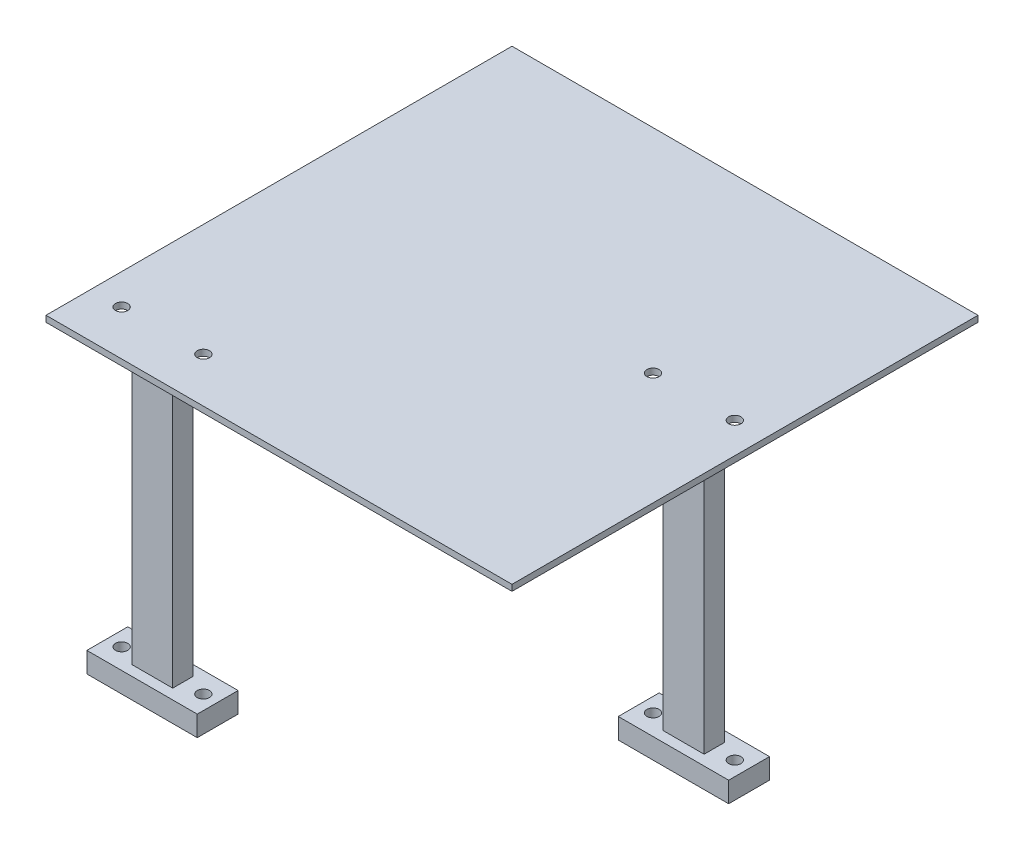
ISO-10303-21;
HEADER;
FILE_DESCRIPTION(('STEP AP214'),'2;1');
FILE_NAME('part.step','',(''),(''),'','','');
FILE_SCHEMA(('AUTOMOTIVE_DESIGN { 1 0 10303 214 1 1 1 1 }'));
ENDSEC;
DATA;
#1=APPLICATION_CONTEXT('core data for automotive mechanical design processes');
#2=APPLICATION_PROTOCOL_DEFINITION('international standard','automotive_design',2000,#1);
#3=PRODUCT_CONTEXT('',#1,'mechanical');
#4=PRODUCT('Part','Part','',(#3));
#5=PRODUCT_RELATED_PRODUCT_CATEGORY('part','',(#4));
#6=PRODUCT_DEFINITION_FORMATION('','',#4);
#7=PRODUCT_DEFINITION_CONTEXT('part definition',#1,'design');
#8=PRODUCT_DEFINITION('design','',#6,#7);
#9=PRODUCT_DEFINITION_SHAPE('','',#8);
#10=(LENGTH_UNIT() NAMED_UNIT(*) SI_UNIT(.MILLI.,.METRE.));
#11=(NAMED_UNIT(*) PLANE_ANGLE_UNIT() SI_UNIT($,.RADIAN.));
#12=(NAMED_UNIT(*) SI_UNIT($,.STERADIAN.) SOLID_ANGLE_UNIT());
#13=UNCERTAINTY_MEASURE_WITH_UNIT(LENGTH_MEASURE(1.E-05),#10,'distance_accuracy_value','');
#14=(GEOMETRIC_REPRESENTATION_CONTEXT(3) GLOBAL_UNCERTAINTY_ASSIGNED_CONTEXT((#13)) GLOBAL_UNIT_ASSIGNED_CONTEXT((#10,
#11,#12)) REPRESENTATION_CONTEXT('',''));
#15=CARTESIAN_POINT('',(0.,0.,0.));
#16=DIRECTION('',(0.,0.,1.));
#17=DIRECTION('',(1.,0.,0.));
#18=AXIS2_PLACEMENT_3D('',#15,#16,#17);
#19=CARTESIAN_POINT('',(0.,1.5,0.));
#20=DIRECTION('',(0.,-1.,0.));
#21=DIRECTION('',(0.,0.,-1.));
#22=AXIS2_PLACEMENT_3D('',#19,#20,#21);
#23=PLANE('',#22);
#24=DIRECTION('',(-1.,0.,0.));
#25=VECTOR('',#24,1.);
#26=CARTESIAN_POINT('',(-57.,1.5,-57.));
#27=LINE('',#26,#25);
#28=CARTESIAN_POINT('',(57.,1.5,-57.));
#29=VERTEX_POINT('',#28);
#30=CARTESIAN_POINT('',(-57.,1.5,-57.));
#31=VERTEX_POINT('',#30);
#32=EDGE_CURVE('E312',#29,#31,#27,.T.);
#33=ORIENTED_EDGE('',*,*,#32,.T.);
#34=DIRECTION('',(0.,0.,1.));
#35=VECTOR('',#34,1.);
#36=CARTESIAN_POINT('',(-57.,1.5,-57.));
#37=LINE('',#36,#35);
#38=CARTESIAN_POINT('',(-57.,1.5,57.));
#39=VERTEX_POINT('',#38);
#40=EDGE_CURVE('E315',#31,#39,#37,.T.);
#41=ORIENTED_EDGE('',*,*,#40,.T.);
#42=DIRECTION('',(1.,0.,0.));
#43=VECTOR('',#42,1.);
#44=CARTESIAN_POINT('',(-57.,1.5,57.));
#45=LINE('',#44,#43);
#46=CARTESIAN_POINT('',(57.,1.5,57.));
#47=VERTEX_POINT('',#46);
#48=EDGE_CURVE('E318',#39,#47,#45,.T.);
#49=ORIENTED_EDGE('',*,*,#48,.T.);
#50=DIRECTION('',(0.,0.,-1.));
#51=VECTOR('',#50,1.);
#52=CARTESIAN_POINT('',(57.,1.5,-57.));
#53=LINE('',#52,#51);
#54=EDGE_CURVE('E320',#47,#29,#53,.T.);
#55=ORIENTED_EDGE('',*,*,#54,.T.);
#56=EDGE_LOOP('',(#33,#41,#49,#55));
#57=FACE_BOUND('',#56,.T.);
#58=CARTESIAN_POINT('',(29.5,1.5,-5.00000000000001));
#59=DIRECTION('',(0.,1.,0.));
#60=DIRECTION('',(0.,0.,1.));
#61=AXIS2_PLACEMENT_3D('',#58,#59,#60);
#62=CIRCLE('',#61,1.5);
#63=CARTESIAN_POINT('',(29.5,1.5,-3.50000000000001));
#64=VERTEX_POINT('',#63);
#65=EDGE_CURVE('E306',#64,#64,#62,.T.);
#66=ORIENTED_EDGE('',*,*,#65,.F.);
#67=EDGE_LOOP('',(#66));
#68=FACE_BOUND('',#67,.T.);
#69=CARTESIAN_POINT('',(49.5,1.5,-5.00000000000002));
#70=DIRECTION('',(0.,1.,0.));
#71=DIRECTION('',(0.,0.,1.));
#72=AXIS2_PLACEMENT_3D('',#69,#70,#71);
#73=CIRCLE('',#72,1.5);
#74=CARTESIAN_POINT('',(49.5,1.5,-3.50000000000001));
#75=VERTEX_POINT('',#74);
#76=EDGE_CURVE('E300',#75,#75,#73,.T.);
#77=ORIENTED_EDGE('',*,*,#76,.F.);
#78=EDGE_LOOP('',(#77));
#79=FACE_BOUND('',#78,.T.);
#80=CARTESIAN_POINT('',(-29.5,1.5,46.));
#81=DIRECTION('',(0.,1.,0.));
#82=DIRECTION('',(0.,0.,1.));
#83=AXIS2_PLACEMENT_3D('',#80,#81,#82);
#84=CIRCLE('',#83,1.5);
#85=CARTESIAN_POINT('',(-29.5,1.5,47.5));
#86=VERTEX_POINT('',#85);
#87=EDGE_CURVE('E294',#86,#86,#84,.T.);
#88=ORIENTED_EDGE('',*,*,#87,.F.);
#89=EDGE_LOOP('',(#88));
#90=FACE_BOUND('',#89,.T.);
#91=CARTESIAN_POINT('',(-49.5,1.5,46.));
#92=DIRECTION('',(0.,1.,0.));
#93=DIRECTION('',(0.,0.,1.));
#94=AXIS2_PLACEMENT_3D('',#91,#92,#93);
#95=CIRCLE('',#94,1.5);
#96=CARTESIAN_POINT('',(-49.5,1.5,47.5));
#97=VERTEX_POINT('',#96);
#98=EDGE_CURVE('E288',#97,#97,#95,.T.);
#99=ORIENTED_EDGE('',*,*,#98,.F.);
#100=EDGE_LOOP('',(#99));
#101=FACE_BOUND('',#100,.T.);
#102=ADVANCED_FACE('F33',(#57,#68,#79,#90,#101),#23,.F.);
#103=CARTESIAN_POINT('',(0.,0.,0.));
#104=DIRECTION('',(0.,-1.,0.));
#105=DIRECTION('',(0.,0.,-1.));
#106=AXIS2_PLACEMENT_3D('',#103,#104,#105);
#107=PLANE('',#106);
#108=DIRECTION('',(0.,0.,1.));
#109=VECTOR('',#108,1.);
#110=CARTESIAN_POINT('',(44.5,0.,0.));
#111=LINE('',#110,#109);
#112=CARTESIAN_POINT('',(44.5,0.,-7.50000000000001));
#113=VERTEX_POINT('',#112);
#114=CARTESIAN_POINT('',(44.5,0.,-2.50000000000001));
#115=VERTEX_POINT('',#114);
#116=EDGE_CURVE('E11',#113,#115,#111,.T.);
#117=ORIENTED_EDGE('',*,*,#116,.F.);
#118=DIRECTION('',(1.,0.,0.));
#119=VECTOR('',#118,1.);
#120=CARTESIAN_POINT('',(0.,0.,-7.50000000000001));
#121=LINE('',#120,#119);
#122=CARTESIAN_POINT('',(34.5,0.,-7.50000000000001));
#123=VERTEX_POINT('',#122);
#124=EDGE_CURVE('E353',#123,#113,#121,.T.);
#125=ORIENTED_EDGE('',*,*,#124,.F.);
#126=DIRECTION('',(0.,0.,-1.));
#127=VECTOR('',#126,1.);
#128=CARTESIAN_POINT('',(34.5,0.,0.));
#129=LINE('',#128,#127);
#130=CARTESIAN_POINT('',(34.5,0.,-2.50000000000001));
#131=VERTEX_POINT('',#130);
#132=EDGE_CURVE('E51',#131,#123,#129,.T.);
#133=ORIENTED_EDGE('',*,*,#132,.F.);
#134=DIRECTION('',(-1.,0.,0.));
#135=VECTOR('',#134,1.);
#136=CARTESIAN_POINT('',(0.,0.,-2.50000000000001));
#137=LINE('',#136,#135);
#138=EDGE_CURVE('E41',#115,#131,#137,.T.);
#139=ORIENTED_EDGE('',*,*,#138,.F.);
#140=EDGE_LOOP('',(#117,#125,#133,#139));
#141=FACE_BOUND('',#140,.T.);
#142=DIRECTION('',(0.,0.,1.));
#143=VECTOR('',#142,1.);
#144=CARTESIAN_POINT('',(-34.5,0.,0.));
#145=LINE('',#144,#143);
#146=CARTESIAN_POINT('',(-34.5,0.,43.5));
#147=VERTEX_POINT('',#146);
#148=CARTESIAN_POINT('',(-34.5,0.,48.5));
#149=VERTEX_POINT('',#148);
#150=EDGE_CURVE('E350',#147,#149,#145,.T.);
#151=ORIENTED_EDGE('',*,*,#150,.F.);
#152=DIRECTION('',(1.,0.,0.));
#153=VECTOR('',#152,1.);
#154=CARTESIAN_POINT('',(0.,0.,43.5));
#155=LINE('',#154,#153);
#156=CARTESIAN_POINT('',(-44.5,0.,43.5));
#157=VERTEX_POINT('',#156);
#158=EDGE_CURVE('E341',#157,#147,#155,.T.);
#159=ORIENTED_EDGE('',*,*,#158,.F.);
#160=DIRECTION('',(0.,0.,-1.));
#161=VECTOR('',#160,1.);
#162=CARTESIAN_POINT('',(-44.5,0.,0.));
#163=LINE('',#162,#161);
#164=CARTESIAN_POINT('',(-44.5,0.,48.5));
#165=VERTEX_POINT('',#164);
#166=EDGE_CURVE('E344',#165,#157,#163,.T.);
#167=ORIENTED_EDGE('',*,*,#166,.F.);
#168=DIRECTION('',(-1.,0.,0.));
#169=VECTOR('',#168,1.);
#170=CARTESIAN_POINT('',(0.,0.,48.5));
#171=LINE('',#170,#169);
#172=EDGE_CURVE('E347',#149,#165,#171,.T.);
#173=ORIENTED_EDGE('',*,*,#172,.F.);
#174=EDGE_LOOP('',(#151,#159,#167,#173));
#175=FACE_BOUND('',#174,.T.);
#176=CARTESIAN_POINT('',(-29.5,0.,46.));
#177=DIRECTION('',(0.,1.,0.));
#178=DIRECTION('',(0.,0.,1.));
#179=AXIS2_PLACEMENT_3D('',#176,#177,#178);
#180=CIRCLE('',#179,1.5);
#181=CARTESIAN_POINT('',(-29.5,0.,47.5));
#182=VERTEX_POINT('',#181);
#183=EDGE_CURVE('E291',#182,#182,#180,.T.);
#184=ORIENTED_EDGE('',*,*,#183,.T.);
#185=EDGE_LOOP('',(#184));
#186=FACE_BOUND('',#185,.T.);
#187=CARTESIAN_POINT('',(29.5,0.,-5.00000000000001));
#188=DIRECTION('',(0.,1.,0.));
#189=DIRECTION('',(0.,0.,1.));
#190=AXIS2_PLACEMENT_3D('',#187,#188,#189);
#191=CIRCLE('',#190,1.5);
#192=CARTESIAN_POINT('',(29.5,0.,-3.50000000000001));
#193=VERTEX_POINT('',#192);
#194=EDGE_CURVE('E303',#193,#193,#191,.T.);
#195=ORIENTED_EDGE('',*,*,#194,.T.);
#196=EDGE_LOOP('',(#195));
#197=FACE_BOUND('',#196,.T.);
#198=DIRECTION('',(-1.,0.,0.));
#199=VECTOR('',#198,1.);
#200=CARTESIAN_POINT('',(-57.,0.,-57.));
#201=LINE('',#200,#199);
#202=CARTESIAN_POINT('',(57.,0.,-57.));
#203=VERTEX_POINT('',#202);
#204=CARTESIAN_POINT('',(-57.,0.,-57.));
#205=VERTEX_POINT('',#204);
#206=EDGE_CURVE('E309',#203,#205,#201,.T.);
#207=ORIENTED_EDGE('',*,*,#206,.F.);
#208=DIRECTION('',(0.,0.,-1.));
#209=VECTOR('',#208,1.);
#210=CARTESIAN_POINT('',(57.,0.,-57.));
#211=LINE('',#210,#209);
#212=CARTESIAN_POINT('',(57.,0.,57.));
#213=VERTEX_POINT('',#212);
#214=EDGE_CURVE('E316',#213,#203,#211,.T.);
#215=ORIENTED_EDGE('',*,*,#214,.F.);
#216=DIRECTION('',(1.,0.,0.));
#217=VECTOR('',#216,1.);
#218=CARTESIAN_POINT('',(-57.,0.,57.));
#219=LINE('',#218,#217);
#220=CARTESIAN_POINT('',(-57.,0.,57.));
#221=VERTEX_POINT('',#220);
#222=EDGE_CURVE('E327',#221,#213,#219,.T.);
#223=ORIENTED_EDGE('',*,*,#222,.F.);
#224=DIRECTION('',(0.,0.,1.));
#225=VECTOR('',#224,1.);
#226=CARTESIAN_POINT('',(-57.,0.,-57.));
#227=LINE('',#226,#225);
#228=EDGE_CURVE('E325',#205,#221,#227,.T.);
#229=ORIENTED_EDGE('',*,*,#228,.F.);
#230=EDGE_LOOP('',(#207,#215,#223,#229));
#231=FACE_BOUND('',#230,.T.);
#232=CARTESIAN_POINT('',(49.5,0.,-5.00000000000002));
#233=DIRECTION('',(0.,1.,0.));
#234=DIRECTION('',(0.,0.,1.));
#235=AXIS2_PLACEMENT_3D('',#232,#233,#234);
#236=CIRCLE('',#235,1.5);
#237=CARTESIAN_POINT('',(49.5,0.,-3.50000000000001));
#238=VERTEX_POINT('',#237);
#239=EDGE_CURVE('E297',#238,#238,#236,.T.);
#240=ORIENTED_EDGE('',*,*,#239,.T.);
#241=EDGE_LOOP('',(#240));
#242=FACE_BOUND('',#241,.T.);
#243=CARTESIAN_POINT('',(-49.5,0.,46.));
#244=DIRECTION('',(0.,1.,0.));
#245=DIRECTION('',(0.,0.,1.));
#246=AXIS2_PLACEMENT_3D('',#243,#244,#245);
#247=CIRCLE('',#246,1.5);
#248=CARTESIAN_POINT('',(-49.5,0.,47.5));
#249=VERTEX_POINT('',#248);
#250=EDGE_CURVE('E279',#249,#249,#247,.T.);
#251=ORIENTED_EDGE('',*,*,#250,.T.);
#252=EDGE_LOOP('',(#251));
#253=FACE_BOUND('',#252,.T.);
#254=ADVANCED_FACE('F369',(#141,#175,#186,#197,#231,#242,#253),#107,.T.);
#255=CARTESIAN_POINT('',(-57.,1.5,-57.));
#256=DIRECTION('',(0.,0.,1.));
#257=DIRECTION('',(1.,0.,0.));
#258=AXIS2_PLACEMENT_3D('',#255,#256,#257);
#259=PLANE('',#258);
#260=ORIENTED_EDGE('',*,*,#206,.T.);
#261=DIRECTION('',(0.,-1.,0.));
#262=VECTOR('',#261,1.);
#263=CARTESIAN_POINT('',(-57.,1.5,-57.));
#264=LINE('',#263,#262);
#265=EDGE_CURVE('E338',#31,#205,#264,.T.);
#266=ORIENTED_EDGE('',*,*,#265,.F.);
#267=ORIENTED_EDGE('',*,*,#32,.F.);
#268=DIRECTION('',(0.,-1.,0.));
#269=VECTOR('',#268,1.);
#270=CARTESIAN_POINT('',(57.,1.5,-57.));
#271=LINE('',#270,#269);
#272=EDGE_CURVE('E322',#29,#203,#271,.T.);
#273=ORIENTED_EDGE('',*,*,#272,.T.);
#274=EDGE_LOOP('',(#260,#266,#267,#273));
#275=FACE_BOUND('',#274,.T.);
#276=ADVANCED_FACE('F35',(#275),#259,.F.);
#277=CARTESIAN_POINT('',(-57.,1.5,-57.));
#278=DIRECTION('',(1.,0.,0.));
#279=DIRECTION('',(0.,0.,-1.));
#280=AXIS2_PLACEMENT_3D('',#277,#278,#279);
#281=PLANE('',#280);
#282=ORIENTED_EDGE('',*,*,#228,.T.);
#283=DIRECTION('',(0.,-1.,0.));
#284=VECTOR('',#283,1.);
#285=CARTESIAN_POINT('',(-57.,1.5,57.));
#286=LINE('',#285,#284);
#287=EDGE_CURVE('E335',#39,#221,#286,.T.);
#288=ORIENTED_EDGE('',*,*,#287,.F.);
#289=ORIENTED_EDGE('',*,*,#40,.F.);
#290=ORIENTED_EDGE('',*,*,#265,.T.);
#291=EDGE_LOOP('',(#282,#288,#289,#290));
#292=FACE_BOUND('',#291,.T.);
#293=ADVANCED_FACE('F403',(#292),#281,.F.);
#294=CARTESIAN_POINT('',(-57.,1.5,57.));
#295=DIRECTION('',(0.,0.,-1.));
#296=DIRECTION('',(-1.,0.,0.));
#297=AXIS2_PLACEMENT_3D('',#294,#295,#296);
#298=PLANE('',#297);
#299=ORIENTED_EDGE('',*,*,#222,.T.);
#300=DIRECTION('',(0.,-1.,0.));
#301=VECTOR('',#300,1.);
#302=CARTESIAN_POINT('',(57.,1.5,57.));
#303=LINE('',#302,#301);
#304=EDGE_CURVE('E332',#47,#213,#303,.T.);
#305=ORIENTED_EDGE('',*,*,#304,.F.);
#306=ORIENTED_EDGE('',*,*,#48,.F.);
#307=ORIENTED_EDGE('',*,*,#287,.T.);
#308=EDGE_LOOP('',(#299,#305,#306,#307));
#309=FACE_BOUND('',#308,.T.);
#310=ADVANCED_FACE('F400',(#309),#298,.F.);
#311=CARTESIAN_POINT('',(57.,1.5,-57.));
#312=DIRECTION('',(-1.,0.,0.));
#313=DIRECTION('',(0.,0.,1.));
#314=AXIS2_PLACEMENT_3D('',#311,#312,#313);
#315=PLANE('',#314);
#316=ORIENTED_EDGE('',*,*,#214,.T.);
#317=ORIENTED_EDGE('',*,*,#272,.F.);
#318=ORIENTED_EDGE('',*,*,#54,.F.);
#319=ORIENTED_EDGE('',*,*,#304,.T.);
#320=EDGE_LOOP('',(#316,#317,#318,#319));
#321=FACE_BOUND('',#320,.T.);
#322=ADVANCED_FACE('F397',(#321),#315,.F.);
#323=CARTESIAN_POINT('',(29.5,1.5,-5.00000000000001));
#324=DIRECTION('',(0.,-1.,0.));
#325=DIRECTION('',(0.,0.,-1.));
#326=AXIS2_PLACEMENT_3D('',#323,#324,#325);
#327=CYLINDRICAL_SURFACE('',#326,1.5);
#328=ORIENTED_EDGE('',*,*,#65,.T.);
#329=EDGE_LOOP('',(#328));
#330=FACE_BOUND('',#329,.T.);
#331=ORIENTED_EDGE('',*,*,#194,.F.);
#332=EDGE_LOOP('',(#331));
#333=FACE_BOUND('',#332,.T.);
#334=ADVANCED_FACE('F394',(#330,#333),#327,.F.);
#335=CARTESIAN_POINT('',(49.5,1.5,-5.00000000000002));
#336=DIRECTION('',(0.,-1.,0.));
#337=DIRECTION('',(0.,0.,-1.));
#338=AXIS2_PLACEMENT_3D('',#335,#336,#337);
#339=CYLINDRICAL_SURFACE('',#338,1.5);
#340=ORIENTED_EDGE('',*,*,#76,.T.);
#341=EDGE_LOOP('',(#340));
#342=FACE_BOUND('',#341,.T.);
#343=ORIENTED_EDGE('',*,*,#239,.F.);
#344=EDGE_LOOP('',(#343));
#345=FACE_BOUND('',#344,.T.);
#346=ADVANCED_FACE('F440',(#342,#345),#339,.F.);
#347=CARTESIAN_POINT('',(-29.5,1.5,46.));
#348=DIRECTION('',(0.,-1.,0.));
#349=DIRECTION('',(0.,0.,-1.));
#350=AXIS2_PLACEMENT_3D('',#347,#348,#349);
#351=CYLINDRICAL_SURFACE('',#350,1.5);
#352=ORIENTED_EDGE('',*,*,#87,.T.);
#353=EDGE_LOOP('',(#352));
#354=FACE_BOUND('',#353,.T.);
#355=ORIENTED_EDGE('',*,*,#183,.F.);
#356=EDGE_LOOP('',(#355));
#357=FACE_BOUND('',#356,.T.);
#358=ADVANCED_FACE('F430',(#354,#357),#351,.F.);
#359=CARTESIAN_POINT('',(-49.5,1.5,46.));
#360=DIRECTION('',(0.,-1.,0.));
#361=DIRECTION('',(0.,0.,-1.));
#362=AXIS2_PLACEMENT_3D('',#359,#360,#361);
#363=CYLINDRICAL_SURFACE('',#362,1.5);
#364=ORIENTED_EDGE('',*,*,#98,.T.);
#365=EDGE_LOOP('',(#364));
#366=FACE_BOUND('',#365,.T.);
#367=ORIENTED_EDGE('',*,*,#250,.F.);
#368=EDGE_LOOP('',(#367));
#369=FACE_BOUND('',#368,.T.);
#370=ADVANCED_FACE('F427',(#366,#369),#363,.F.);
#371=CARTESIAN_POINT('',(-34.5,-70.5,43.5));
#372=DIRECTION('',(1.,0.,0.));
#373=DIRECTION('',(0.,0.,-1.));
#374=AXIS2_PLACEMENT_3D('',#371,#372,#373);
#375=PLANE('',#374);
#376=DIRECTION('',(0.,1.,0.));
#377=VECTOR('',#376,1.);
#378=CARTESIAN_POINT('',(-34.5,-70.5,43.5));
#379=LINE('',#378,#377);
#380=CARTESIAN_POINT('',(-34.5,-70.5,43.5));
#381=VERTEX_POINT('',#380);
#382=EDGE_CURVE('E275',#381,#147,#379,.T.);
#383=ORIENTED_EDGE('',*,*,#382,.T.);
#384=ORIENTED_EDGE('',*,*,#150,.T.);
#385=DIRECTION('',(0.,1.,0.));
#386=VECTOR('',#385,1.);
#387=CARTESIAN_POINT('',(-34.5,-70.5,48.5));
#388=LINE('',#387,#386);
#389=CARTESIAN_POINT('',(-34.5,-70.5,48.5));
#390=VERTEX_POINT('',#389);
#391=EDGE_CURVE('E276',#390,#149,#388,.T.);
#392=ORIENTED_EDGE('',*,*,#391,.F.);
#393=DIRECTION('',(0.,0.,-1.));
#394=VECTOR('',#393,1.);
#395=CARTESIAN_POINT('',(-34.5,-70.5,43.5));
#396=LINE('',#395,#394);
#397=EDGE_CURVE('E255',#390,#381,#396,.T.);
#398=ORIENTED_EDGE('',*,*,#397,.T.);
#399=EDGE_LOOP('',(#383,#384,#392,#398));
#400=FACE_BOUND('',#399,.T.);
#401=ADVANCED_FACE('F429',(#400),#375,.T.);
#402=CARTESIAN_POINT('',(-44.5,-70.5,48.5));
#403=DIRECTION('',(0.,0.,1.));
#404=DIRECTION('',(1.,0.,0.));
#405=AXIS2_PLACEMENT_3D('',#402,#403,#404);
#406=PLANE('',#405);
#407=ORIENTED_EDGE('',*,*,#391,.T.);
#408=ORIENTED_EDGE('',*,*,#172,.T.);
#409=DIRECTION('',(0.,1.,0.));
#410=VECTOR('',#409,1.);
#411=CARTESIAN_POINT('',(-44.5,-70.5,48.5));
#412=LINE('',#411,#410);
#413=CARTESIAN_POINT('',(-44.5,-70.5,48.5));
#414=VERTEX_POINT('',#413);
#415=EDGE_CURVE('E280',#414,#165,#412,.T.);
#416=ORIENTED_EDGE('',*,*,#415,.F.);
#417=DIRECTION('',(1.,0.,0.));
#418=VECTOR('',#417,1.);
#419=CARTESIAN_POINT('',(-44.5,-70.5,48.5));
#420=LINE('',#419,#418);
#421=EDGE_CURVE('E272',#414,#390,#420,.T.);
#422=ORIENTED_EDGE('',*,*,#421,.T.);
#423=EDGE_LOOP('',(#407,#408,#416,#422));
#424=FACE_BOUND('',#423,.T.);
#425=ADVANCED_FACE('F437',(#424),#406,.T.);
#426=CARTESIAN_POINT('',(-44.5,-70.5,43.5));
#427=DIRECTION('',(-1.,0.,0.));
#428=DIRECTION('',(0.,0.,1.));
#429=AXIS2_PLACEMENT_3D('',#426,#427,#428);
#430=PLANE('',#429);
#431=ORIENTED_EDGE('',*,*,#415,.T.);
#432=ORIENTED_EDGE('',*,*,#166,.T.);
#433=DIRECTION('',(0.,1.,0.));
#434=VECTOR('',#433,1.);
#435=CARTESIAN_POINT('',(-44.5,-70.5,43.5));
#436=LINE('',#435,#434);
#437=CARTESIAN_POINT('',(-44.5,-70.5,43.5));
#438=VERTEX_POINT('',#437);
#439=EDGE_CURVE('E283',#438,#157,#436,.T.);
#440=ORIENTED_EDGE('',*,*,#439,.F.);
#441=DIRECTION('',(0.,0.,1.));
#442=VECTOR('',#441,1.);
#443=CARTESIAN_POINT('',(-44.5,-70.5,43.5));
#444=LINE('',#443,#442);
#445=EDGE_CURVE('E269',#438,#414,#444,.T.);
#446=ORIENTED_EDGE('',*,*,#445,.T.);
#447=EDGE_LOOP('',(#431,#432,#440,#446));
#448=FACE_BOUND('',#447,.T.);
#449=ADVANCED_FACE('F508',(#448),#430,.T.);
#450=CARTESIAN_POINT('',(-44.5,-70.5,43.5));
#451=DIRECTION('',(0.,0.,-1.));
#452=DIRECTION('',(-1.,0.,0.));
#453=AXIS2_PLACEMENT_3D('',#450,#451,#452);
#454=PLANE('',#453);
#455=ORIENTED_EDGE('',*,*,#439,.T.);
#456=ORIENTED_EDGE('',*,*,#158,.T.);
#457=ORIENTED_EDGE('',*,*,#382,.F.);
#458=DIRECTION('',(-1.,0.,0.));
#459=VECTOR('',#458,1.);
#460=CARTESIAN_POINT('',(-44.5,-70.5,43.5));
#461=LINE('',#460,#459);
#462=EDGE_CURVE('E266',#381,#438,#461,.T.);
#463=ORIENTED_EDGE('',*,*,#462,.T.);
#464=EDGE_LOOP('',(#455,#456,#457,#463));
#465=FACE_BOUND('',#464,.T.);
#466=ADVANCED_FACE('F518',(#465),#454,.T.);
#467=CARTESIAN_POINT('',(44.5,-70.5,-7.50000000000001));
#468=DIRECTION('',(1.,0.,0.));
#469=DIRECTION('',(0.,0.,-1.));
#470=AXIS2_PLACEMENT_3D('',#467,#468,#469);
#471=PLANE('',#470);
#472=DIRECTION('',(0.,1.,0.));
#473=VECTOR('',#472,1.);
#474=CARTESIAN_POINT('',(44.5,-70.5,-7.50000000000001));
#475=LINE('',#474,#473);
#476=CARTESIAN_POINT('',(44.5,-70.5,-7.50000000000001));
#477=VERTEX_POINT('',#476);
#478=EDGE_CURVE('E251',#477,#113,#475,.T.);
#479=ORIENTED_EDGE('',*,*,#478,.T.);
#480=ORIENTED_EDGE('',*,*,#116,.T.);
#481=DIRECTION('',(0.,1.,0.));
#482=VECTOR('',#481,1.);
#483=CARTESIAN_POINT('',(44.5,-70.5,-2.50000000000001));
#484=LINE('',#483,#482);
#485=CARTESIAN_POINT('',(44.5,-70.5,-2.50000000000001));
#486=VERTEX_POINT('',#485);
#487=EDGE_CURVE('E252',#486,#115,#484,.T.);
#488=ORIENTED_EDGE('',*,*,#487,.F.);
#489=DIRECTION('',(0.,0.,-1.));
#490=VECTOR('',#489,1.);
#491=CARTESIAN_POINT('',(44.5,-70.5,-7.50000000000001));
#492=LINE('',#491,#490);
#493=EDGE_CURVE('E239',#486,#477,#492,.T.);
#494=ORIENTED_EDGE('',*,*,#493,.T.);
#495=EDGE_LOOP('',(#479,#480,#488,#494));
#496=FACE_BOUND('',#495,.T.);
#497=ADVANCED_FACE('F368',(#496),#471,.T.);
#498=CARTESIAN_POINT('',(34.5,-70.5,-2.50000000000001));
#499=DIRECTION('',(0.,0.,1.));
#500=DIRECTION('',(1.,0.,0.));
#501=AXIS2_PLACEMENT_3D('',#498,#499,#500);
#502=PLANE('',#501);
#503=ORIENTED_EDGE('',*,*,#487,.T.);
#504=ORIENTED_EDGE('',*,*,#138,.T.);
#505=DIRECTION('',(0.,1.,0.));
#506=VECTOR('',#505,1.);
#507=CARTESIAN_POINT('',(34.5,-70.5,-2.50000000000001));
#508=LINE('',#507,#506);
#509=CARTESIAN_POINT('',(34.5,-70.5,-2.50000000000001));
#510=VERTEX_POINT('',#509);
#511=EDGE_CURVE('E256',#510,#131,#508,.T.);
#512=ORIENTED_EDGE('',*,*,#511,.F.);
#513=DIRECTION('',(1.,0.,0.));
#514=VECTOR('',#513,1.);
#515=CARTESIAN_POINT('',(34.5,-70.5,-2.50000000000001));
#516=LINE('',#515,#514);
#517=EDGE_CURVE('E248',#510,#486,#516,.T.);
#518=ORIENTED_EDGE('',*,*,#517,.T.);
#519=EDGE_LOOP('',(#503,#504,#512,#518));
#520=FACE_BOUND('',#519,.T.);
#521=ADVANCED_FACE('F358',(#520),#502,.T.);
#522=CARTESIAN_POINT('',(34.5,-70.5,-7.50000000000001));
#523=DIRECTION('',(-1.,0.,0.));
#524=DIRECTION('',(0.,0.,1.));
#525=AXIS2_PLACEMENT_3D('',#522,#523,#524);
#526=PLANE('',#525);
#527=ORIENTED_EDGE('',*,*,#511,.T.);
#528=ORIENTED_EDGE('',*,*,#132,.T.);
#529=DIRECTION('',(0.,1.,0.));
#530=VECTOR('',#529,1.);
#531=CARTESIAN_POINT('',(34.5,-70.5,-7.50000000000001));
#532=LINE('',#531,#530);
#533=CARTESIAN_POINT('',(34.5,-70.5,-7.50000000000001));
#534=VERTEX_POINT('',#533);
#535=EDGE_CURVE('E259',#534,#123,#532,.T.);
#536=ORIENTED_EDGE('',*,*,#535,.F.);
#537=DIRECTION('',(0.,0.,1.));
#538=VECTOR('',#537,1.);
#539=CARTESIAN_POINT('',(34.5,-70.5,-7.50000000000001));
#540=LINE('',#539,#538);
#541=EDGE_CURVE('E245',#534,#510,#540,.T.);
#542=ORIENTED_EDGE('',*,*,#541,.T.);
#543=EDGE_LOOP('',(#527,#528,#536,#542));
#544=FACE_BOUND('',#543,.T.);
#545=ADVANCED_FACE('F361',(#544),#526,.T.);
#546=CARTESIAN_POINT('',(34.5,-70.5,-7.50000000000001));
#547=DIRECTION('',(0.,0.,-1.));
#548=DIRECTION('',(-1.,0.,0.));
#549=AXIS2_PLACEMENT_3D('',#546,#547,#548);
#550=PLANE('',#549);
#551=ORIENTED_EDGE('',*,*,#535,.T.);
#552=ORIENTED_EDGE('',*,*,#124,.T.);
#553=ORIENTED_EDGE('',*,*,#478,.F.);
#554=DIRECTION('',(-1.,0.,0.));
#555=VECTOR('',#554,1.);
#556=CARTESIAN_POINT('',(34.5,-70.5,-7.50000000000001));
#557=LINE('',#556,#555);
#558=EDGE_CURVE('E242',#477,#534,#557,.T.);
#559=ORIENTED_EDGE('',*,*,#558,.T.);
#560=EDGE_LOOP('',(#551,#552,#553,#559));
#561=FACE_BOUND('',#560,.T.);
#562=ADVANCED_FACE('F372',(#561),#550,.T.);
#563=CARTESIAN_POINT('',(0.,-75.5,0.));
#564=DIRECTION('',(0.,-1.,0.));
#565=DIRECTION('',(0.,0.,-1.));
#566=AXIS2_PLACEMENT_3D('',#563,#564,#565);
#567=PLANE('',#566);
#568=CARTESIAN_POINT('',(-49.5,-75.5,46.));
#569=DIRECTION('',(0.,-1.,0.));
#570=DIRECTION('',(0.,0.,-1.));
#571=AXIS2_PLACEMENT_3D('',#568,#569,#570);
#572=CIRCLE('',#571,1.5);
#573=CARTESIAN_POINT('',(-49.5,-75.5,44.5));
#574=VERTEX_POINT('',#573);
#575=EDGE_CURVE('E204',#574,#574,#572,.T.);
#576=ORIENTED_EDGE('',*,*,#575,.F.);
#577=EDGE_LOOP('',(#576));
#578=FACE_BOUND('',#577,.T.);
#579=DIRECTION('',(0.,0.,-1.));
#580=VECTOR('',#579,1.);
#581=CARTESIAN_POINT('',(-53.,-75.5,41.));
#582=LINE('',#581,#580);
#583=CARTESIAN_POINT('',(-53.,-75.5,51.));
#584=VERTEX_POINT('',#583);
#585=CARTESIAN_POINT('',(-53.,-75.5,41.));
#586=VERTEX_POINT('',#585);
#587=EDGE_CURVE('E210',#584,#586,#582,.T.);
#588=ORIENTED_EDGE('',*,*,#587,.T.);
#589=DIRECTION('',(1.,0.,0.));
#590=VECTOR('',#589,1.);
#591=CARTESIAN_POINT('',(-26.,-75.5,41.));
#592=LINE('',#591,#590);
#593=CARTESIAN_POINT('',(-26.,-75.5,41.));
#594=VERTEX_POINT('',#593);
#595=EDGE_CURVE('E213',#586,#594,#592,.T.);
#596=ORIENTED_EDGE('',*,*,#595,.T.);
#597=DIRECTION('',(0.,0.,1.));
#598=VECTOR('',#597,1.);
#599=CARTESIAN_POINT('',(-26.,-75.5,41.));
#600=LINE('',#599,#598);
#601=CARTESIAN_POINT('',(-26.,-75.5,51.));
#602=VERTEX_POINT('',#601);
#603=EDGE_CURVE('E216',#594,#602,#600,.T.);
#604=ORIENTED_EDGE('',*,*,#603,.T.);
#605=DIRECTION('',(-1.,0.,0.));
#606=VECTOR('',#605,1.);
#607=CARTESIAN_POINT('',(-26.,-75.5,51.));
#608=LINE('',#607,#606);
#609=EDGE_CURVE('E218',#602,#584,#608,.T.);
#610=ORIENTED_EDGE('',*,*,#609,.T.);
#611=EDGE_LOOP('',(#588,#596,#604,#610));
#612=FACE_BOUND('',#611,.T.);
#613=CARTESIAN_POINT('',(-29.5,-75.5,46.));
#614=DIRECTION('',(0.,-1.,0.));
#615=DIRECTION('',(0.,0.,-1.));
#616=AXIS2_PLACEMENT_3D('',#613,#614,#615);
#617=CIRCLE('',#616,1.5);
#618=CARTESIAN_POINT('',(-29.5,-75.5,44.5));
#619=VERTEX_POINT('',#618);
#620=EDGE_CURVE('E195',#619,#619,#617,.T.);
#621=ORIENTED_EDGE('',*,*,#620,.F.);
#622=EDGE_LOOP('',(#621));
#623=FACE_BOUND('',#622,.T.);
#624=ADVANCED_FACE('F374',(#578,#612,#623),#567,.T.);
#625=CARTESIAN_POINT('',(0.,-70.5,0.));
#626=DIRECTION('',(0.,-1.,0.));
#627=DIRECTION('',(0.,0.,-1.));
#628=AXIS2_PLACEMENT_3D('',#625,#626,#627);
#629=PLANE('',#628);
#630=ORIENTED_EDGE('',*,*,#397,.F.);
#631=ORIENTED_EDGE('',*,*,#421,.F.);
#632=ORIENTED_EDGE('',*,*,#445,.F.);
#633=ORIENTED_EDGE('',*,*,#462,.F.);
#634=EDGE_LOOP('',(#630,#631,#632,#633));
#635=FACE_BOUND('',#634,.T.);
#636=DIRECTION('',(0.,0.,-1.));
#637=VECTOR('',#636,1.);
#638=CARTESIAN_POINT('',(-53.,-70.5,41.));
#639=LINE('',#638,#637);
#640=CARTESIAN_POINT('',(-53.,-70.5,51.));
#641=VERTEX_POINT('',#640);
#642=CARTESIAN_POINT('',(-53.,-70.5,41.));
#643=VERTEX_POINT('',#642);
#644=EDGE_CURVE('E207',#641,#643,#639,.T.);
#645=ORIENTED_EDGE('',*,*,#644,.F.);
#646=DIRECTION('',(-1.,0.,0.));
#647=VECTOR('',#646,1.);
#648=CARTESIAN_POINT('',(-26.,-70.5,51.));
#649=LINE('',#648,#647);
#650=CARTESIAN_POINT('',(-26.,-70.5,51.));
#651=VERTEX_POINT('',#650);
#652=EDGE_CURVE('E214',#651,#641,#649,.T.);
#653=ORIENTED_EDGE('',*,*,#652,.F.);
#654=DIRECTION('',(0.,0.,1.));
#655=VECTOR('',#654,1.);
#656=CARTESIAN_POINT('',(-26.,-70.5,41.));
#657=LINE('',#656,#655);
#658=CARTESIAN_POINT('',(-26.,-70.5,41.));
#659=VERTEX_POINT('',#658);
#660=EDGE_CURVE('E225',#659,#651,#657,.T.);
#661=ORIENTED_EDGE('',*,*,#660,.F.);
#662=DIRECTION('',(1.,0.,0.));
#663=VECTOR('',#662,1.);
#664=CARTESIAN_POINT('',(-26.,-70.5,41.));
#665=LINE('',#664,#663);
#666=EDGE_CURVE('E223',#643,#659,#665,.T.);
#667=ORIENTED_EDGE('',*,*,#666,.F.);
#668=EDGE_LOOP('',(#645,#653,#661,#667));
#669=FACE_BOUND('',#668,.T.);
#670=CARTESIAN_POINT('',(-49.5,-70.5,46.));
#671=DIRECTION('',(0.,-1.,0.));
#672=DIRECTION('',(0.,0.,-1.));
#673=AXIS2_PLACEMENT_3D('',#670,#671,#672);
#674=CIRCLE('',#673,1.5);
#675=CARTESIAN_POINT('',(-49.5,-70.5,44.5));
#676=VERTEX_POINT('',#675);
#677=EDGE_CURVE('E202',#676,#676,#674,.T.);
#678=ORIENTED_EDGE('',*,*,#677,.T.);
#679=EDGE_LOOP('',(#678));
#680=FACE_BOUND('',#679,.T.);
#681=CARTESIAN_POINT('',(-29.5,-70.5,46.));
#682=DIRECTION('',(0.,-1.,0.));
#683=DIRECTION('',(0.,0.,-1.));
#684=AXIS2_PLACEMENT_3D('',#681,#682,#683);
#685=CIRCLE('',#684,1.5);
#686=CARTESIAN_POINT('',(-29.5,-70.5,44.5));
#687=VERTEX_POINT('',#686);
#688=EDGE_CURVE('E192',#687,#687,#685,.T.);
#689=ORIENTED_EDGE('',*,*,#688,.T.);
#690=EDGE_LOOP('',(#689));
#691=FACE_BOUND('',#690,.T.);
#692=ADVANCED_FACE('F380',(#635,#669,#680,#691),#629,.F.);
#693=CARTESIAN_POINT('',(-53.,-75.5,41.));
#694=DIRECTION('',(1.,0.,0.));
#695=DIRECTION('',(0.,0.,-1.));
#696=AXIS2_PLACEMENT_3D('',#693,#694,#695);
#697=PLANE('',#696);
#698=ORIENTED_EDGE('',*,*,#644,.T.);
#699=DIRECTION('',(0.,1.,0.));
#700=VECTOR('',#699,1.);
#701=CARTESIAN_POINT('',(-53.,-75.5,41.));
#702=LINE('',#701,#700);
#703=EDGE_CURVE('E236',#586,#643,#702,.T.);
#704=ORIENTED_EDGE('',*,*,#703,.F.);
#705=ORIENTED_EDGE('',*,*,#587,.F.);
#706=DIRECTION('',(0.,1.,0.));
#707=VECTOR('',#706,1.);
#708=CARTESIAN_POINT('',(-53.,-75.5,51.));
#709=LINE('',#708,#707);
#710=EDGE_CURVE('E220',#584,#641,#709,.T.);
#711=ORIENTED_EDGE('',*,*,#710,.T.);
#712=EDGE_LOOP('',(#698,#704,#705,#711));
#713=FACE_BOUND('',#712,.T.);
#714=ADVANCED_FACE('F567',(#713),#697,.F.);
#715=CARTESIAN_POINT('',(-26.,-75.5,41.));
#716=DIRECTION('',(0.,0.,1.));
#717=DIRECTION('',(1.,0.,0.));
#718=AXIS2_PLACEMENT_3D('',#715,#716,#717);
#719=PLANE('',#718);
#720=ORIENTED_EDGE('',*,*,#666,.T.);
#721=DIRECTION('',(0.,1.,0.));
#722=VECTOR('',#721,1.);
#723=CARTESIAN_POINT('',(-26.,-75.5,41.));
#724=LINE('',#723,#722);
#725=EDGE_CURVE('E233',#594,#659,#724,.T.);
#726=ORIENTED_EDGE('',*,*,#725,.F.);
#727=ORIENTED_EDGE('',*,*,#595,.F.);
#728=ORIENTED_EDGE('',*,*,#703,.T.);
#729=EDGE_LOOP('',(#720,#726,#727,#728));
#730=FACE_BOUND('',#729,.T.);
#731=ADVANCED_FACE('F577',(#730),#719,.F.);
#732=CARTESIAN_POINT('',(-26.,-75.5,41.));
#733=DIRECTION('',(-1.,0.,0.));
#734=DIRECTION('',(0.,0.,1.));
#735=AXIS2_PLACEMENT_3D('',#732,#733,#734);
#736=PLANE('',#735);
#737=ORIENTED_EDGE('',*,*,#660,.T.);
#738=DIRECTION('',(0.,1.,0.));
#739=VECTOR('',#738,1.);
#740=CARTESIAN_POINT('',(-26.,-75.5,51.));
#741=LINE('',#740,#739);
#742=EDGE_CURVE('E230',#602,#651,#741,.T.);
#743=ORIENTED_EDGE('',*,*,#742,.F.);
#744=ORIENTED_EDGE('',*,*,#603,.F.);
#745=ORIENTED_EDGE('',*,*,#725,.T.);
#746=EDGE_LOOP('',(#737,#743,#744,#745));
#747=FACE_BOUND('',#746,.T.);
#748=ADVANCED_FACE('F587',(#747),#736,.F.);
#749=CARTESIAN_POINT('',(-26.,-75.5,51.));
#750=DIRECTION('',(0.,0.,-1.));
#751=DIRECTION('',(-1.,0.,0.));
#752=AXIS2_PLACEMENT_3D('',#749,#750,#751);
#753=PLANE('',#752);
#754=ORIENTED_EDGE('',*,*,#652,.T.);
#755=ORIENTED_EDGE('',*,*,#710,.F.);
#756=ORIENTED_EDGE('',*,*,#609,.F.);
#757=ORIENTED_EDGE('',*,*,#742,.T.);
#758=EDGE_LOOP('',(#754,#755,#756,#757));
#759=FACE_BOUND('',#758,.T.);
#760=ADVANCED_FACE('F597',(#759),#753,.F.);
#761=CARTESIAN_POINT('',(-49.5,-75.5,46.));
#762=DIRECTION('',(0.,1.,0.));
#763=DIRECTION('',(0.,0.,1.));
#764=AXIS2_PLACEMENT_3D('',#761,#762,#763);
#765=CYLINDRICAL_SURFACE('',#764,1.5);
#766=ORIENTED_EDGE('',*,*,#575,.T.);
#767=EDGE_LOOP('',(#766));
#768=FACE_BOUND('',#767,.T.);
#769=ORIENTED_EDGE('',*,*,#677,.F.);
#770=EDGE_LOOP('',(#769));
#771=FACE_BOUND('',#770,.T.);
#772=ADVANCED_FACE('F607',(#768,#771),#765,.F.);
#773=CARTESIAN_POINT('',(-29.5,-75.5,46.));
#774=DIRECTION('',(0.,1.,0.));
#775=DIRECTION('',(0.,0.,1.));
#776=AXIS2_PLACEMENT_3D('',#773,#774,#775);
#777=CYLINDRICAL_SURFACE('',#776,1.5);
#778=ORIENTED_EDGE('',*,*,#620,.T.);
#779=EDGE_LOOP('',(#778));
#780=FACE_BOUND('',#779,.T.);
#781=ORIENTED_EDGE('',*,*,#688,.F.);
#782=EDGE_LOOP('',(#781));
#783=FACE_BOUND('',#782,.T.);
#784=ADVANCED_FACE('F617',(#780,#783),#777,.F.);
#785=CARTESIAN_POINT('',(0.,-75.5,0.));
#786=DIRECTION('',(0.,-1.,0.));
#787=DIRECTION('',(0.,0.,-1.));
#788=AXIS2_PLACEMENT_3D('',#785,#786,#787);
#789=PLANE('',#788);
#790=CARTESIAN_POINT('',(29.5,-75.5,-5.00000000000001));
#791=DIRECTION('',(0.,-1.,0.));
#792=DIRECTION('',(0.,0.,-1.));
#793=AXIS2_PLACEMENT_3D('',#790,#791,#792);
#794=CIRCLE('',#793,1.5);
#795=CARTESIAN_POINT('',(29.5,-75.5,-6.50000000000001));
#796=VERTEX_POINT('',#795);
#797=EDGE_CURVE('E716',#796,#796,#794,.T.);
#798=ORIENTED_EDGE('',*,*,#797,.F.);
#799=EDGE_LOOP('',(#798));
#800=FACE_BOUND('',#799,.T.);
#801=DIRECTION('',(0.,0.,-1.));
#802=VECTOR('',#801,1.);
#803=CARTESIAN_POINT('',(26.,-75.5,-10.));
#804=LINE('',#803,#802);
#805=CARTESIAN_POINT('',(26.,-75.5,0.));
#806=VERTEX_POINT('',#805);
#807=CARTESIAN_POINT('',(26.,-75.5,-10.));
#808=VERTEX_POINT('',#807);
#809=EDGE_CURVE('E177',#806,#808,#804,.T.);
#810=ORIENTED_EDGE('',*,*,#809,.T.);
#811=DIRECTION('',(1.,0.,0.));
#812=VECTOR('',#811,1.);
#813=CARTESIAN_POINT('',(53.,-75.5,-10.));
#814=LINE('',#813,#812);
#815=CARTESIAN_POINT('',(53.,-75.5,-10.));
#816=VERTEX_POINT('',#815);
#817=EDGE_CURVE('E166',#808,#816,#814,.T.);
#818=ORIENTED_EDGE('',*,*,#817,.T.);
#819=DIRECTION('',(0.,0.,1.));
#820=VECTOR('',#819,1.);
#821=CARTESIAN_POINT('',(53.,-75.5,-10.));
#822=LINE('',#821,#820);
#823=CARTESIAN_POINT('',(53.,-75.5,0.));
#824=VERTEX_POINT('',#823);
#825=EDGE_CURVE('E176',#816,#824,#822,.T.);
#826=ORIENTED_EDGE('',*,*,#825,.T.);
#827=DIRECTION('',(-1.,0.,0.));
#828=VECTOR('',#827,1.);
#829=CARTESIAN_POINT('',(53.,-75.5,0.));
#830=LINE('',#829,#828);
#831=EDGE_CURVE('E183',#824,#806,#830,.T.);
#832=ORIENTED_EDGE('',*,*,#831,.T.);
#833=EDGE_LOOP('',(#810,#818,#826,#832));
#834=FACE_BOUND('',#833,.T.);
#835=CARTESIAN_POINT('',(49.5,-75.5,-5.00000000000002));
#836=DIRECTION('',(0.,-1.,0.));
#837=DIRECTION('',(0.,0.,-1.));
#838=AXIS2_PLACEMENT_3D('',#835,#836,#837);
#839=CIRCLE('',#838,1.5);
#840=CARTESIAN_POINT('',(49.5,-75.5,-6.50000000000002));
#841=VERTEX_POINT('',#840);
#842=EDGE_CURVE('E707',#841,#841,#839,.T.);
#843=ORIENTED_EDGE('',*,*,#842,.F.);
#844=EDGE_LOOP('',(#843));
#845=FACE_BOUND('',#844,.T.);
#846=ADVANCED_FACE('F180',(#800,#834,#845),#789,.T.);
#847=CARTESIAN_POINT('',(0.,-70.5,0.));
#848=DIRECTION('',(0.,-1.,0.));
#849=DIRECTION('',(0.,0.,-1.));
#850=AXIS2_PLACEMENT_3D('',#847,#848,#849);
#851=PLANE('',#850);
#852=ORIENTED_EDGE('',*,*,#493,.F.);
#853=ORIENTED_EDGE('',*,*,#517,.F.);
#854=ORIENTED_EDGE('',*,*,#541,.F.);
#855=ORIENTED_EDGE('',*,*,#558,.F.);
#856=EDGE_LOOP('',(#852,#853,#854,#855));
#857=FACE_BOUND('',#856,.T.);
#858=DIRECTION('',(0.,0.,-1.));
#859=VECTOR('',#858,1.);
#860=CARTESIAN_POINT('',(26.,-70.5,-10.));
#861=LINE('',#860,#859);
#862=CARTESIAN_POINT('',(26.,-70.5,0.));
#863=VERTEX_POINT('',#862);
#864=CARTESIAN_POINT('',(26.,-70.5,-10.));
#865=VERTEX_POINT('',#864);
#866=EDGE_CURVE('E191',#863,#865,#861,.T.);
#867=ORIENTED_EDGE('',*,*,#866,.F.);
#868=DIRECTION('',(-1.,0.,0.));
#869=VECTOR('',#868,1.);
#870=CARTESIAN_POINT('',(53.,-70.5,0.));
#871=LINE('',#870,#869);
#872=CARTESIAN_POINT('',(53.,-70.5,0.));
#873=VERTEX_POINT('',#872);
#874=EDGE_CURVE('E187',#873,#863,#871,.T.);
#875=ORIENTED_EDGE('',*,*,#874,.F.);
#876=DIRECTION('',(0.,0.,1.));
#877=VECTOR('',#876,1.);
#878=CARTESIAN_POINT('',(53.,-70.5,-10.));
#879=LINE('',#878,#877);
#880=CARTESIAN_POINT('',(53.,-70.5,-10.));
#881=VERTEX_POINT('',#880);
#882=EDGE_CURVE('E727',#881,#873,#879,.T.);
#883=ORIENTED_EDGE('',*,*,#882,.F.);
#884=DIRECTION('',(1.,0.,0.));
#885=VECTOR('',#884,1.);
#886=CARTESIAN_POINT('',(53.,-70.5,-10.));
#887=LINE('',#886,#885);
#888=EDGE_CURVE('E725',#865,#881,#887,.T.);
#889=ORIENTED_EDGE('',*,*,#888,.F.);
#890=EDGE_LOOP('',(#867,#875,#883,#889));
#891=FACE_BOUND('',#890,.T.);
#892=CARTESIAN_POINT('',(29.5,-70.5,-5.00000000000001));
#893=DIRECTION('',(0.,-1.,0.));
#894=DIRECTION('',(0.,0.,-1.));
#895=AXIS2_PLACEMENT_3D('',#892,#893,#894);
#896=CIRCLE('',#895,1.5);
#897=CARTESIAN_POINT('',(29.5,-70.5,-6.50000000000001));
#898=VERTEX_POINT('',#897);
#899=EDGE_CURVE('E713',#898,#898,#896,.T.);
#900=ORIENTED_EDGE('',*,*,#899,.T.);
#901=EDGE_LOOP('',(#900));
#902=FACE_BOUND('',#901,.T.);
#903=CARTESIAN_POINT('',(49.5,-70.5,-5.00000000000002));
#904=DIRECTION('',(0.,-1.,0.));
#905=DIRECTION('',(0.,0.,-1.));
#906=AXIS2_PLACEMENT_3D('',#903,#904,#905);
#907=CIRCLE('',#906,1.5);
#908=CARTESIAN_POINT('',(49.5,-70.5,-6.50000000000002));
#909=VERTEX_POINT('',#908);
#910=EDGE_CURVE('E710',#909,#909,#907,.T.);
#911=ORIENTED_EDGE('',*,*,#910,.T.);
#912=EDGE_LOOP('',(#911));
#913=FACE_BOUND('',#912,.T.);
#914=ADVANCED_FACE('F364',(#857,#891,#902,#913),#851,.F.);
#915=CARTESIAN_POINT('',(26.,-75.5,-10.));
#916=DIRECTION('',(1.,0.,0.));
#917=DIRECTION('',(0.,0.,-1.));
#918=AXIS2_PLACEMENT_3D('',#915,#916,#917);
#919=PLANE('',#918);
#920=ORIENTED_EDGE('',*,*,#866,.T.);
#921=DIRECTION('',(0.,1.,0.));
#922=VECTOR('',#921,1.);
#923=CARTESIAN_POINT('',(26.,-75.5,-10.));
#924=LINE('',#923,#922);
#925=EDGE_CURVE('E170',#808,#865,#924,.T.);
#926=ORIENTED_EDGE('',*,*,#925,.F.);
#927=ORIENTED_EDGE('',*,*,#809,.F.);
#928=DIRECTION('',(0.,1.,0.));
#929=VECTOR('',#928,1.);
#930=CARTESIAN_POINT('',(26.,-75.5,0.));
#931=LINE('',#930,#929);
#932=EDGE_CURVE('E723',#806,#863,#931,.T.);
#933=ORIENTED_EDGE('',*,*,#932,.T.);
#934=EDGE_LOOP('',(#920,#926,#927,#933));
#935=FACE_BOUND('',#934,.T.);
#936=ADVANCED_FACE('F189',(#935),#919,.F.);
#937=CARTESIAN_POINT('',(53.,-75.5,-10.));
#938=DIRECTION('',(0.,0.,1.));
#939=DIRECTION('',(1.,0.,0.));
#940=AXIS2_PLACEMENT_3D('',#937,#938,#939);
#941=PLANE('',#940);
#942=ORIENTED_EDGE('',*,*,#888,.T.);
#943=DIRECTION('',(0.,1.,0.));
#944=VECTOR('',#943,1.);
#945=CARTESIAN_POINT('',(53.,-75.5,-10.));
#946=LINE('',#945,#944);
#947=EDGE_CURVE('E173',#816,#881,#946,.T.);
#948=ORIENTED_EDGE('',*,*,#947,.F.);
#949=ORIENTED_EDGE('',*,*,#817,.F.);
#950=ORIENTED_EDGE('',*,*,#925,.T.);
#951=EDGE_LOOP('',(#942,#948,#949,#950));
#952=FACE_BOUND('',#951,.T.);
#953=ADVANCED_FACE('F168',(#952),#941,.F.);
#954=CARTESIAN_POINT('',(53.,-75.5,-10.));
#955=DIRECTION('',(-1.,0.,0.));
#956=DIRECTION('',(0.,0.,1.));
#957=AXIS2_PLACEMENT_3D('',#954,#955,#956);
#958=PLANE('',#957);
#959=ORIENTED_EDGE('',*,*,#882,.T.);
#960=DIRECTION('',(0.,1.,0.));
#961=VECTOR('',#960,1.);
#962=CARTESIAN_POINT('',(53.,-75.5,0.));
#963=LINE('',#962,#961);
#964=EDGE_CURVE('E197',#824,#873,#963,.T.);
#965=ORIENTED_EDGE('',*,*,#964,.F.);
#966=ORIENTED_EDGE('',*,*,#825,.F.);
#967=ORIENTED_EDGE('',*,*,#947,.T.);
#968=EDGE_LOOP('',(#959,#965,#966,#967));
#969=FACE_BOUND('',#968,.T.);
#970=ADVANCED_FACE('F661',(#969),#958,.F.);
#971=CARTESIAN_POINT('',(53.,-75.5,0.));
#972=DIRECTION('',(0.,0.,-1.));
#973=DIRECTION('',(-1.,0.,0.));
#974=AXIS2_PLACEMENT_3D('',#971,#972,#973);
#975=PLANE('',#974);
#976=ORIENTED_EDGE('',*,*,#874,.T.);
#977=ORIENTED_EDGE('',*,*,#932,.F.);
#978=ORIENTED_EDGE('',*,*,#831,.F.);
#979=ORIENTED_EDGE('',*,*,#964,.T.);
#980=EDGE_LOOP('',(#976,#977,#978,#979));
#981=FACE_BOUND('',#980,.T.);
#982=ADVANCED_FACE('F670',(#981),#975,.F.);
#983=CARTESIAN_POINT('',(29.5,-75.5,-5.00000000000001));
#984=DIRECTION('',(0.,1.,0.));
#985=DIRECTION('',(0.,0.,1.));
#986=AXIS2_PLACEMENT_3D('',#983,#984,#985);
#987=CYLINDRICAL_SURFACE('',#986,1.5);
#988=ORIENTED_EDGE('',*,*,#797,.T.);
#989=EDGE_LOOP('',(#988));
#990=FACE_BOUND('',#989,.T.);
#991=ORIENTED_EDGE('',*,*,#899,.F.);
#992=EDGE_LOOP('',(#991));
#993=FACE_BOUND('',#992,.T.);
#994=ADVANCED_FACE('F680',(#990,#993),#987,.F.);
#995=CARTESIAN_POINT('',(49.5,-75.5,-5.00000000000002));
#996=DIRECTION('',(0.,1.,0.));
#997=DIRECTION('',(0.,0.,1.));
#998=AXIS2_PLACEMENT_3D('',#995,#996,#997);
#999=CYLINDRICAL_SURFACE('',#998,1.5);
#1000=ORIENTED_EDGE('',*,*,#842,.T.);
#1001=EDGE_LOOP('',(#1000));
#1002=FACE_BOUND('',#1001,.T.);
#1003=ORIENTED_EDGE('',*,*,#910,.F.);
#1004=EDGE_LOOP('',(#1003));
#1005=FACE_BOUND('',#1004,.T.);
#1006=ADVANCED_FACE('F690',(#1002,#1005),#999,.F.);
#1007=CLOSED_SHELL('',(#102,#254,#276,#293,#310,#322,#334,#346,#358,#370,#401,#425,#449,#466,
#497,#521,#545,#562,#624,#692,#714,#731,#748,#760,#772,#784,#846,#914,#936,#953,#970,#982,#994,#1006));
#1008=MANIFOLD_SOLID_BREP('B2',#1007);
#1009=ADVANCED_BREP_SHAPE_REPRESENTATION('',(#18,#1008),#14);
#1010=SHAPE_DEFINITION_REPRESENTATION(#9,#1009);
ENDSEC;
END-ISO-10303-21;
